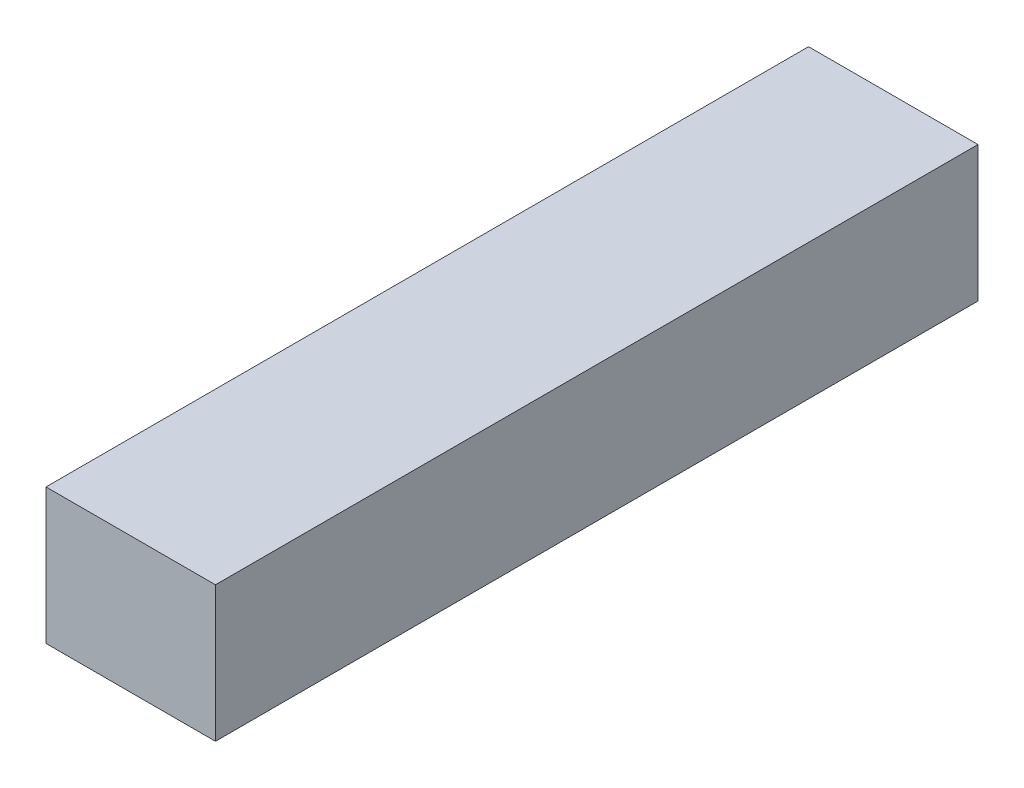
ISO-10303-21;
HEADER;
FILE_DESCRIPTION(('STEP AP214'),'2;1');
FILE_NAME('part.step','',(''),(''),'','','');
FILE_SCHEMA(('AUTOMOTIVE_DESIGN { 1 0 10303 214 1 1 1 1 }'));
ENDSEC;
DATA;
#1=APPLICATION_CONTEXT('core data for automotive mechanical design processes');
#2=APPLICATION_PROTOCOL_DEFINITION('international standard','automotive_design',2000,#1);
#3=PRODUCT_CONTEXT('',#1,'mechanical');
#4=PRODUCT('Part','Part','',(#3));
#5=PRODUCT_RELATED_PRODUCT_CATEGORY('part','',(#4));
#6=PRODUCT_DEFINITION_FORMATION('','',#4);
#7=PRODUCT_DEFINITION_CONTEXT('part definition',#1,'design');
#8=PRODUCT_DEFINITION('design','',#6,#7);
#9=PRODUCT_DEFINITION_SHAPE('','',#8);
#10=(LENGTH_UNIT() NAMED_UNIT(*) SI_UNIT(.MILLI.,.METRE.));
#11=(NAMED_UNIT(*) PLANE_ANGLE_UNIT() SI_UNIT($,.RADIAN.));
#12=(NAMED_UNIT(*) SI_UNIT($,.STERADIAN.) SOLID_ANGLE_UNIT());
#13=UNCERTAINTY_MEASURE_WITH_UNIT(LENGTH_MEASURE(1.E-05),#10,'distance_accuracy_value','');
#14=(GEOMETRIC_REPRESENTATION_CONTEXT(3) GLOBAL_UNCERTAINTY_ASSIGNED_CONTEXT((#13)) GLOBAL_UNIT_ASSIGNED_CONTEXT((#10,
#11,#12)) REPRESENTATION_CONTEXT('',''));
#15=CARTESIAN_POINT('',(0.,0.,0.));
#16=DIRECTION('',(0.,0.,1.));
#17=DIRECTION('',(1.,0.,0.));
#18=AXIS2_PLACEMENT_3D('',#15,#16,#17);
#19=CARTESIAN_POINT('',(0.,0.,-45.));
#20=DIRECTION('',(-1.,0.,0.));
#21=DIRECTION('',(0.,-1.,0.));
#22=AXIS2_PLACEMENT_3D('',#19,#20,#21);
#23=PLANE('',#22);
#24=DIRECTION('',(0.,-1.,0.));
#25=VECTOR('',#24,1.);
#26=CARTESIAN_POINT('',(0.,0.,0.));
#27=LINE('',#26,#25);
#28=CARTESIAN_POINT('',(0.,0.,0.));
#29=VERTEX_POINT('',#28);
#30=CARTESIAN_POINT('',(0.,-8.,0.));
#31=VERTEX_POINT('',#30);
#32=EDGE_CURVE('E100',#29,#31,#27,.T.);
#33=ORIENTED_EDGE('',*,*,#32,.F.);
#34=DIRECTION('',(0.,0.,1.));
#35=VECTOR('',#34,1.);
#36=CARTESIAN_POINT('',(0.,0.,-45.));
#37=LINE('',#36,#35);
#38=CARTESIAN_POINT('',(0.,0.,-45.));
#39=VERTEX_POINT('',#38);
#40=EDGE_CURVE('E11',#39,#29,#37,.T.);
#41=ORIENTED_EDGE('',*,*,#40,.F.);
#42=DIRECTION('',(0.,-1.,0.));
#43=VECTOR('',#42,1.);
#44=CARTESIAN_POINT('',(0.,0.,-45.));
#45=LINE('',#44,#43);
#46=CARTESIAN_POINT('',(0.,-8.,-45.));
#47=VERTEX_POINT('',#46);
#48=EDGE_CURVE('E94',#39,#47,#45,.T.);
#49=ORIENTED_EDGE('',*,*,#48,.T.);
#50=DIRECTION('',(0.,0.,1.));
#51=VECTOR('',#50,1.);
#52=CARTESIAN_POINT('',(0.,-8.,-45.));
#53=LINE('',#52,#51);
#54=EDGE_CURVE('E39',#47,#31,#53,.T.);
#55=ORIENTED_EDGE('',*,*,#54,.T.);
#56=EDGE_LOOP('',(#33,#41,#49,#55));
#57=FACE_BOUND('',#56,.T.);
#58=ADVANCED_FACE('F36',(#57),#23,.T.);
#59=CARTESIAN_POINT('',(0.,0.,-45.));
#60=DIRECTION('',(0.,1.,0.));
#61=DIRECTION('',(0.,0.,1.));
#62=AXIS2_PLACEMENT_3D('',#59,#60,#61);
#63=PLANE('',#62);
#64=DIRECTION('',(-1.,0.,0.));
#65=VECTOR('',#64,1.);
#66=CARTESIAN_POINT('',(0.,0.,0.));
#67=LINE('',#66,#65);
#68=CARTESIAN_POINT('',(10.,0.,0.));
#69=VERTEX_POINT('',#68);
#70=EDGE_CURVE('E96',#69,#29,#67,.T.);
#71=ORIENTED_EDGE('',*,*,#70,.F.);
#72=DIRECTION('',(0.,0.,1.));
#73=VECTOR('',#72,1.);
#74=CARTESIAN_POINT('',(10.,0.,-45.));
#75=LINE('',#74,#73);
#76=CARTESIAN_POINT('',(10.,0.,-45.));
#77=VERTEX_POINT('',#76);
#78=EDGE_CURVE('E45',#77,#69,#75,.T.);
#79=ORIENTED_EDGE('',*,*,#78,.F.);
#80=DIRECTION('',(-1.,0.,0.));
#81=VECTOR('',#80,1.);
#82=CARTESIAN_POINT('',(0.,0.,-45.));
#83=LINE('',#82,#81);
#84=EDGE_CURVE('E91',#77,#39,#83,.T.);
#85=ORIENTED_EDGE('',*,*,#84,.T.);
#86=ORIENTED_EDGE('',*,*,#40,.T.);
#87=EDGE_LOOP('',(#71,#79,#85,#86));
#88=FACE_BOUND('',#87,.T.);
#89=ADVANCED_FACE('F110',(#88),#63,.T.);
#90=CARTESIAN_POINT('',(10.,0.,-45.));
#91=DIRECTION('',(1.,0.,0.));
#92=DIRECTION('',(0.,0.,-1.));
#93=AXIS2_PLACEMENT_3D('',#90,#91,#92);
#94=PLANE('',#93);
#95=DIRECTION('',(0.,1.,0.));
#96=VECTOR('',#95,1.);
#97=CARTESIAN_POINT('',(10.,0.,0.));
#98=LINE('',#97,#96);
#99=CARTESIAN_POINT('',(10.,-8.,0.));
#100=VERTEX_POINT('',#99);
#101=EDGE_CURVE('E86',#100,#69,#98,.T.);
#102=ORIENTED_EDGE('',*,*,#101,.F.);
#103=DIRECTION('',(0.,0.,1.));
#104=VECTOR('',#103,1.);
#105=CARTESIAN_POINT('',(10.,-8.,-45.));
#106=LINE('',#105,#104);
#107=CARTESIAN_POINT('',(10.,-8.,-45.));
#108=VERTEX_POINT('',#107);
#109=EDGE_CURVE('E81',#108,#100,#106,.T.);
#110=ORIENTED_EDGE('',*,*,#109,.F.);
#111=DIRECTION('',(0.,1.,0.));
#112=VECTOR('',#111,1.);
#113=CARTESIAN_POINT('',(10.,0.,-45.));
#114=LINE('',#113,#112);
#115=EDGE_CURVE('E84',#108,#77,#114,.T.);
#116=ORIENTED_EDGE('',*,*,#115,.T.);
#117=ORIENTED_EDGE('',*,*,#78,.T.);
#118=EDGE_LOOP('',(#102,#110,#116,#117));
#119=FACE_BOUND('',#118,.T.);
#120=ADVANCED_FACE('F83',(#119),#94,.T.);
#121=CARTESIAN_POINT('',(0.,-8.,-45.));
#122=DIRECTION('',(0.,-1.,0.));
#123=DIRECTION('',(0.,0.,-1.));
#124=AXIS2_PLACEMENT_3D('',#121,#122,#123);
#125=PLANE('',#124);
#126=DIRECTION('',(1.,0.,0.));
#127=VECTOR('',#126,1.);
#128=CARTESIAN_POINT('',(0.,-8.,0.));
#129=LINE('',#128,#127);
#130=EDGE_CURVE('E103',#31,#100,#129,.T.);
#131=ORIENTED_EDGE('',*,*,#130,.F.);
#132=ORIENTED_EDGE('',*,*,#54,.F.);
#133=DIRECTION('',(1.,0.,0.));
#134=VECTOR('',#133,1.);
#135=CARTESIAN_POINT('',(0.,-8.,-45.));
#136=LINE('',#135,#134);
#137=EDGE_CURVE('E90',#47,#108,#136,.T.);
#138=ORIENTED_EDGE('',*,*,#137,.T.);
#139=ORIENTED_EDGE('',*,*,#109,.T.);
#140=EDGE_LOOP('',(#131,#132,#138,#139));
#141=FACE_BOUND('',#140,.T.);
#142=ADVANCED_FACE('F93',(#141),#125,.T.);
#143=CARTESIAN_POINT('',(0.,0.,-45.));
#144=DIRECTION('',(0.,0.,1.));
#145=DIRECTION('',(1.,0.,0.));
#146=AXIS2_PLACEMENT_3D('',#143,#144,#145);
#147=PLANE('',#146);
#148=ORIENTED_EDGE('',*,*,#48,.F.);
#149=ORIENTED_EDGE('',*,*,#84,.F.);
#150=ORIENTED_EDGE('',*,*,#115,.F.);
#151=ORIENTED_EDGE('',*,*,#137,.F.);
#152=EDGE_LOOP('',(#148,#149,#150,#151));
#153=FACE_BOUND('',#152,.T.);
#154=ADVANCED_FACE('F89',(#153),#147,.F.);
#155=CARTESIAN_POINT('',(0.,0.,0.));
#156=DIRECTION('',(0.,0.,1.));
#157=DIRECTION('',(1.,0.,0.));
#158=AXIS2_PLACEMENT_3D('',#155,#156,#157);
#159=PLANE('',#158);
#160=ORIENTED_EDGE('',*,*,#32,.T.);
#161=ORIENTED_EDGE('',*,*,#130,.T.);
#162=ORIENTED_EDGE('',*,*,#101,.T.);
#163=ORIENTED_EDGE('',*,*,#70,.T.);
#164=EDGE_LOOP('',(#160,#161,#162,#163));
#165=FACE_BOUND('',#164,.T.);
#166=ADVANCED_FACE('F109',(#165),#159,.T.);
#167=CLOSED_SHELL('',(#58,#89,#120,#142,#154,#166));
#168=MANIFOLD_SOLID_BREP('B2',#167);
#169=ADVANCED_BREP_SHAPE_REPRESENTATION('',(#18,#168),#14);
#170=SHAPE_DEFINITION_REPRESENTATION(#9,#169);
ENDSEC;
END-ISO-10303-21;
